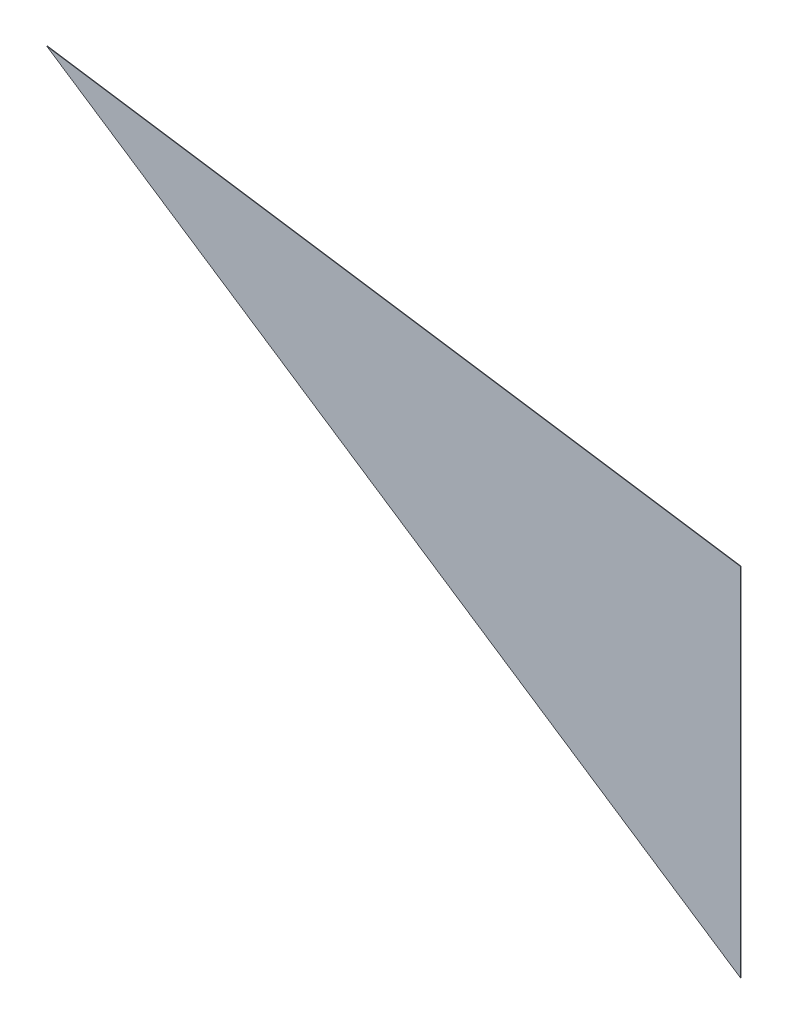
ISO-10303-21;
HEADER;
FILE_DESCRIPTION(('STEP AP214'),'2;1');
FILE_NAME('part.step','',(''),(''),'','','');
FILE_SCHEMA(('AUTOMOTIVE_DESIGN { 1 0 10303 214 1 1 1 1 }'));
ENDSEC;
DATA;
#1=APPLICATION_CONTEXT('core data for automotive mechanical design processes');
#2=APPLICATION_PROTOCOL_DEFINITION('international standard','automotive_design',2000,#1);
#3=PRODUCT_CONTEXT('',#1,'mechanical');
#4=PRODUCT('Part','Part','',(#3));
#5=PRODUCT_RELATED_PRODUCT_CATEGORY('part','',(#4));
#6=PRODUCT_DEFINITION_FORMATION('','',#4);
#7=PRODUCT_DEFINITION_CONTEXT('part definition',#1,'design');
#8=PRODUCT_DEFINITION('design','',#6,#7);
#9=PRODUCT_DEFINITION_SHAPE('','',#8);
#10=(LENGTH_UNIT() NAMED_UNIT(*) SI_UNIT(.MILLI.,.METRE.));
#11=(NAMED_UNIT(*) PLANE_ANGLE_UNIT() SI_UNIT($,.RADIAN.));
#12=(NAMED_UNIT(*) SI_UNIT($,.STERADIAN.) SOLID_ANGLE_UNIT());
#13=UNCERTAINTY_MEASURE_WITH_UNIT(LENGTH_MEASURE(1.E-05),#10,'distance_accuracy_value','');
#14=(GEOMETRIC_REPRESENTATION_CONTEXT(3) GLOBAL_UNCERTAINTY_ASSIGNED_CONTEXT((#13)) GLOBAL_UNIT_ASSIGNED_CONTEXT((#10,
#11,#12)) REPRESENTATION_CONTEXT('',''));
#15=CARTESIAN_POINT('',(0.,0.,0.));
#16=DIRECTION('',(0.,0.,1.));
#17=DIRECTION('',(1.,0.,0.));
#18=AXIS2_PLACEMENT_3D('',#15,#16,#17);
#19=CARTESIAN_POINT('',(-210.680056234935,173.373216465761,0.5));
#20=DIRECTION('',(-0.147851118919844,-0.989009629191824,0.));
#21=DIRECTION('',(0.989009629191825,-0.147851118919844,0.));
#22=AXIS2_PLACEMENT_3D('',#19,#20,#21);
#23=PLANE('',#22);
#24=DIRECTION('',(-0.989009629191824,0.147851118919844,0.));
#25=VECTOR('',#24,1.);
#26=CARTESIAN_POINT('',(-210.680056234935,173.373216465761,0.));
#27=LINE('',#26,#25);
#28=CARTESIAN_POINT('',(-210.680056234935,173.373216465761,0.));
#29=VERTEX_POINT('',#28);
#30=CARTESIAN_POINT('',(-859.317008091907,270.340623328298,0.));
#31=VERTEX_POINT('',#30);
#32=EDGE_CURVE('E82',#29,#31,#27,.T.);
#33=ORIENTED_EDGE('',*,*,#32,.T.);
#34=DIRECTION('',(0.,0.,-1.));
#35=VECTOR('',#34,1.);
#36=CARTESIAN_POINT('',(-859.317008091907,270.340623328298,0.5));
#37=LINE('',#36,#35);
#38=CARTESIAN_POINT('',(-859.317008091907,270.340623328298,0.5));
#39=VERTEX_POINT('',#38);
#40=EDGE_CURVE('E11',#39,#31,#37,.T.);
#41=ORIENTED_EDGE('',*,*,#40,.F.);
#42=DIRECTION('',(-0.989009629191824,0.147851118919844,0.));
#43=VECTOR('',#42,1.);
#44=CARTESIAN_POINT('',(-210.680056234935,173.373216465761,0.5));
#45=LINE('',#44,#43);
#46=CARTESIAN_POINT('',(-210.680056234935,173.373216465761,0.5));
#47=VERTEX_POINT('',#46);
#48=EDGE_CURVE('E75',#47,#39,#45,.T.);
#49=ORIENTED_EDGE('',*,*,#48,.F.);
#50=DIRECTION('',(0.,0.,-1.));
#51=VECTOR('',#50,1.);
#52=CARTESIAN_POINT('',(-210.680056234935,173.373216465761,0.5));
#53=LINE('',#52,#51);
#54=EDGE_CURVE('E83',#47,#29,#53,.T.);
#55=ORIENTED_EDGE('',*,*,#54,.T.);
#56=EDGE_LOOP('',(#33,#41,#49,#55));
#57=FACE_BOUND('',#56,.T.);
#58=ADVANCED_FACE('F35',(#57),#23,.F.);
#59=CARTESIAN_POINT('',(-210.680056234935,-159.825581884861,0.5));
#60=DIRECTION('',(0.552689714472756,0.833387112640952,0.));
#61=DIRECTION('',(-0.833387112640952,0.552689714472756,0.));
#62=AXIS2_PLACEMENT_3D('',#59,#60,#61);
#63=PLANE('',#62);
#64=DIRECTION('',(0.833387112640952,-0.552689714472756,0.));
#65=VECTOR('',#64,1.);
#66=CARTESIAN_POINT('',(-210.680056234935,-159.825581884861,0.));
#67=LINE('',#66,#65);
#68=CARTESIAN_POINT('',(-210.680056234935,-159.825581884861,0.));
#69=VERTEX_POINT('',#68);
#70=EDGE_CURVE('E63',#31,#69,#67,.T.);
#71=ORIENTED_EDGE('',*,*,#70,.T.);
#72=DIRECTION('',(0.,0.,-1.));
#73=VECTOR('',#72,1.);
#74=CARTESIAN_POINT('',(-210.680056234935,-159.825581884861,0.5));
#75=LINE('',#74,#73);
#76=CARTESIAN_POINT('',(-210.680056234935,-159.825581884861,0.5));
#77=VERTEX_POINT('',#76);
#78=EDGE_CURVE('E43',#77,#69,#75,.T.);
#79=ORIENTED_EDGE('',*,*,#78,.F.);
#80=DIRECTION('',(0.833387112640952,-0.552689714472756,0.));
#81=VECTOR('',#80,1.);
#82=CARTESIAN_POINT('',(-210.680056234935,-159.825581884861,0.5));
#83=LINE('',#82,#81);
#84=EDGE_CURVE('E71',#39,#77,#83,.T.);
#85=ORIENTED_EDGE('',*,*,#84,.F.);
#86=ORIENTED_EDGE('',*,*,#40,.T.);
#87=EDGE_LOOP('',(#71,#79,#85,#86));
#88=FACE_BOUND('',#87,.T.);
#89=ADVANCED_FACE('F72',(#88),#63,.F.);
#90=CARTESIAN_POINT('',(-210.680056234935,173.373216465761,0.5));
#91=DIRECTION('',(-1.,0.,0.));
#92=DIRECTION('',(0.,0.,1.));
#93=AXIS2_PLACEMENT_3D('',#90,#91,#92);
#94=PLANE('',#93);
#95=DIRECTION('',(0.,1.,0.));
#96=VECTOR('',#95,1.);
#97=CARTESIAN_POINT('',(-210.680056234935,173.373216465761,0.));
#98=LINE('',#97,#96);
#99=EDGE_CURVE('E68',#69,#29,#98,.T.);
#100=ORIENTED_EDGE('',*,*,#99,.T.);
#101=ORIENTED_EDGE('',*,*,#54,.F.);
#102=DIRECTION('',(0.,1.,0.));
#103=VECTOR('',#102,1.);
#104=CARTESIAN_POINT('',(-210.680056234935,173.373216465761,0.5));
#105=LINE('',#104,#103);
#106=EDGE_CURVE('E51',#77,#47,#105,.T.);
#107=ORIENTED_EDGE('',*,*,#106,.F.);
#108=ORIENTED_EDGE('',*,*,#78,.T.);
#109=EDGE_LOOP('',(#100,#101,#107,#108));
#110=FACE_BOUND('',#109,.T.);
#111=ADVANCED_FACE('F90',(#110),#94,.F.);
#112=CARTESIAN_POINT('',(0.,0.,0.5));
#113=DIRECTION('',(0.,0.,1.));
#114=DIRECTION('',(1.,0.,0.));
#115=AXIS2_PLACEMENT_3D('',#112,#113,#114);
#116=PLANE('',#115);
#117=ORIENTED_EDGE('',*,*,#48,.T.);
#118=ORIENTED_EDGE('',*,*,#84,.T.);
#119=ORIENTED_EDGE('',*,*,#106,.T.);
#120=EDGE_LOOP('',(#117,#118,#119));
#121=FACE_BOUND('',#120,.T.);
#122=ADVANCED_FACE('F78',(#121),#116,.T.);
#123=CARTESIAN_POINT('',(0.,0.,0.));
#124=DIRECTION('',(0.,0.,1.));
#125=DIRECTION('',(1.,0.,0.));
#126=AXIS2_PLACEMENT_3D('',#123,#124,#125);
#127=PLANE('',#126);
#128=ORIENTED_EDGE('',*,*,#32,.F.);
#129=ORIENTED_EDGE('',*,*,#99,.F.);
#130=ORIENTED_EDGE('',*,*,#70,.F.);
#131=EDGE_LOOP('',(#128,#129,#130));
#132=FACE_BOUND('',#131,.T.);
#133=ADVANCED_FACE('F91',(#132),#127,.F.);
#134=CLOSED_SHELL('',(#58,#89,#111,#122,#133));
#135=MANIFOLD_SOLID_BREP('B2',#134);
#136=ADVANCED_BREP_SHAPE_REPRESENTATION('',(#18,#135),#14);
#137=SHAPE_DEFINITION_REPRESENTATION(#9,#136);
ENDSEC;
END-ISO-10303-21;
